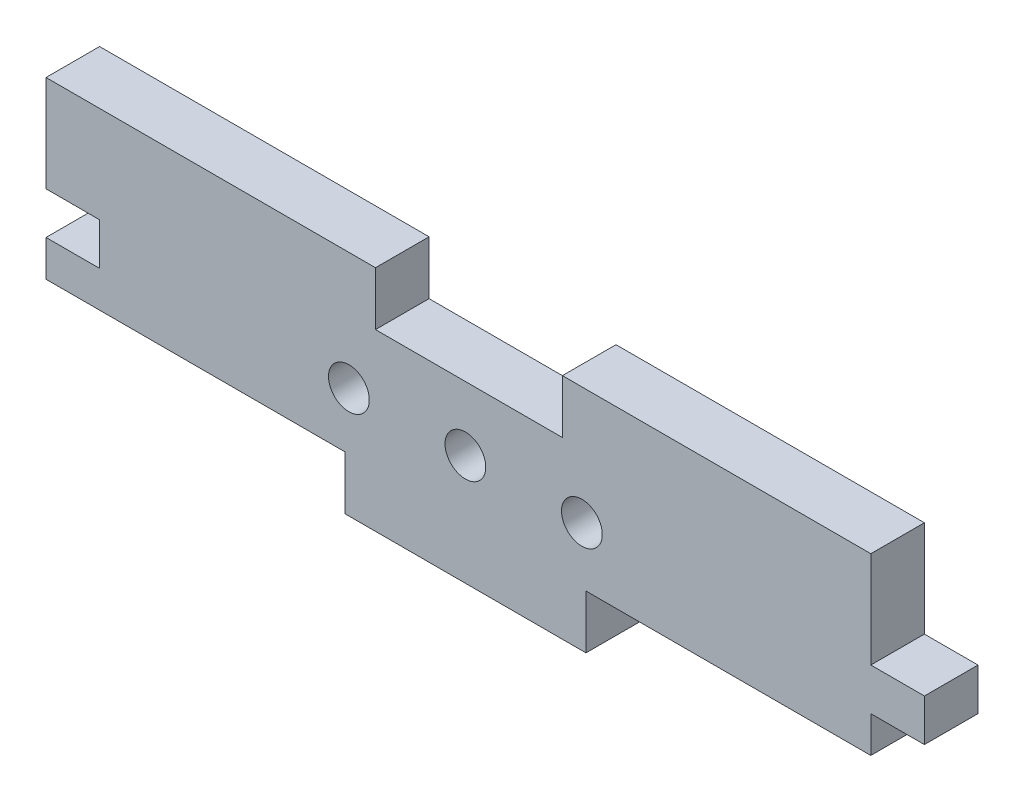
ISO-10303-21;
HEADER;
FILE_DESCRIPTION(('STEP AP214'),'2;1');
FILE_NAME('part.step','',(''),(''),'','','');
FILE_SCHEMA(('AUTOMOTIVE_DESIGN { 1 0 10303 214 1 1 1 1 }'));
ENDSEC;
DATA;
#1=APPLICATION_CONTEXT('core data for automotive mechanical design processes');
#2=APPLICATION_PROTOCOL_DEFINITION('international standard','automotive_design',2000,#1);
#3=PRODUCT_CONTEXT('',#1,'mechanical');
#4=PRODUCT('Part','Part','',(#3));
#5=PRODUCT_RELATED_PRODUCT_CATEGORY('part','',(#4));
#6=PRODUCT_DEFINITION_FORMATION('','',#4);
#7=PRODUCT_DEFINITION_CONTEXT('part definition',#1,'design');
#8=PRODUCT_DEFINITION('design','',#6,#7);
#9=PRODUCT_DEFINITION_SHAPE('','',#8);
#10=(LENGTH_UNIT() NAMED_UNIT(*) SI_UNIT(.MILLI.,.METRE.));
#11=(NAMED_UNIT(*) PLANE_ANGLE_UNIT() SI_UNIT($,.RADIAN.));
#12=(NAMED_UNIT(*) SI_UNIT($,.STERADIAN.) SOLID_ANGLE_UNIT());
#13=UNCERTAINTY_MEASURE_WITH_UNIT(LENGTH_MEASURE(1.E-05),#10,'distance_accuracy_value','');
#14=(GEOMETRIC_REPRESENTATION_CONTEXT(3) GLOBAL_UNCERTAINTY_ASSIGNED_CONTEXT((#13)) GLOBAL_UNIT_ASSIGNED_CONTEXT((#10,
#11,#12)) REPRESENTATION_CONTEXT('',''));
#15=CARTESIAN_POINT('',(0.,0.,0.));
#16=DIRECTION('',(0.,0.,1.));
#17=DIRECTION('',(1.,0.,0.));
#18=AXIS2_PLACEMENT_3D('',#15,#16,#17);
#19=CARTESIAN_POINT('',(0.,15.,4.6));
#20=DIRECTION('',(0.,-1.,0.));
#21=DIRECTION('',(0.,0.,-1.));
#22=AXIS2_PLACEMENT_3D('',#19,#20,#21);
#23=PLANE('',#22);
#24=DIRECTION('',(0.,0.,-1.));
#25=VECTOR('',#24,1.);
#26=CARTESIAN_POINT('',(28.2821640285442,15.,0.));
#27=LINE('',#26,#25);
#28=CARTESIAN_POINT('',(28.2821640285442,15.,4.6));
#29=VERTEX_POINT('',#28);
#30=CARTESIAN_POINT('',(28.2821640285442,15.,0.));
#31=VERTEX_POINT('',#30);
#32=EDGE_CURVE('E348',#29,#31,#27,.T.);
#33=ORIENTED_EDGE('',*,*,#32,.T.);
#34=DIRECTION('',(-1.,0.,0.));
#35=VECTOR('',#34,1.);
#36=CARTESIAN_POINT('',(0.,15.,0.));
#37=LINE('',#36,#35);
#38=CARTESIAN_POINT('',(0.,15.,0.));
#39=VERTEX_POINT('',#38);
#40=EDGE_CURVE('E214',#31,#39,#37,.T.);
#41=ORIENTED_EDGE('',*,*,#40,.T.);
#42=DIRECTION('',(0.,0.,-1.));
#43=VECTOR('',#42,1.);
#44=CARTESIAN_POINT('',(0.,15.,4.6));
#45=LINE('',#44,#43);
#46=CARTESIAN_POINT('',(0.,15.,4.6));
#47=VERTEX_POINT('',#46);
#48=EDGE_CURVE('E228',#47,#39,#45,.T.);
#49=ORIENTED_EDGE('',*,*,#48,.F.);
#50=DIRECTION('',(-1.,0.,0.));
#51=VECTOR('',#50,1.);
#52=CARTESIAN_POINT('',(0.,15.,4.6));
#53=LINE('',#52,#51);
#54=EDGE_CURVE('E301',#29,#47,#53,.T.);
#55=ORIENTED_EDGE('',*,*,#54,.F.);
#56=EDGE_LOOP('',(#33,#41,#49,#55));
#57=FACE_BOUND('',#56,.T.);
#58=ADVANCED_FACE('F31',(#57),#23,.F.);
#59=DIRECTION('',(0.,0.,1.));
#60=VECTOR('',#59,1.);
#61=CARTESIAN_POINT('',(44.3256091099346,15.,0.));
#62=LINE('',#61,#60);
#63=CARTESIAN_POINT('',(44.3256091099346,15.,0.));
#64=VERTEX_POINT('',#63);
#65=CARTESIAN_POINT('',(44.3256091099346,15.,4.6));
#66=VERTEX_POINT('',#65);
#67=EDGE_CURVE('E46',#64,#66,#62,.T.);
#68=ORIENTED_EDGE('',*,*,#67,.T.);
#69=CARTESIAN_POINT('',(70.8,15.,4.6));
#70=VERTEX_POINT('',#69);
#71=EDGE_CURVE('E302',#70,#66,#53,.T.);
#72=ORIENTED_EDGE('',*,*,#71,.F.);
#73=DIRECTION('',(0.,0.,-1.));
#74=VECTOR('',#73,1.);
#75=CARTESIAN_POINT('',(70.8,15.,4.6));
#76=LINE('',#75,#74);
#77=CARTESIAN_POINT('',(70.8,15.,0.));
#78=VERTEX_POINT('',#77);
#79=EDGE_CURVE('E231',#70,#78,#76,.T.);
#80=ORIENTED_EDGE('',*,*,#79,.T.);
#81=EDGE_CURVE('E215',#78,#64,#37,.T.);
#82=ORIENTED_EDGE('',*,*,#81,.T.);
#83=EDGE_LOOP('',(#68,#72,#80,#82));
#84=FACE_BOUND('',#83,.T.);
#85=ADVANCED_FACE('F378',(#84),#23,.F.);
#86=CARTESIAN_POINT('',(0.,3.10839082158942,4.6));
#87=DIRECTION('',(0.,0.,-1.));
#88=DIRECTION('',(-1.,0.,0.));
#89=AXIS2_PLACEMENT_3D('',#86,#87,#88);
#90=PLANE('',#89);
#91=CARTESIAN_POINT('',(36.,4.9,4.6));
#92=DIRECTION('',(0.,0.,-1.));
#93=DIRECTION('',(-1.,0.,0.));
#94=AXIS2_PLACEMENT_3D('',#91,#92,#93);
#95=CIRCLE('',#94,1.75);
#96=CARTESIAN_POINT('',(34.25,4.9,4.6));
#97=VERTEX_POINT('',#96);
#98=EDGE_CURVE('E194',#97,#97,#95,.T.);
#99=ORIENTED_EDGE('',*,*,#98,.T.);
#100=EDGE_LOOP('',(#99));
#101=FACE_BOUND('',#100,.T.);
#102=CARTESIAN_POINT('',(26.,4.9,4.6));
#103=DIRECTION('',(0.,0.,-1.));
#104=DIRECTION('',(-1.,0.,0.));
#105=AXIS2_PLACEMENT_3D('',#102,#103,#104);
#106=CIRCLE('',#105,1.75);
#107=CARTESIAN_POINT('',(24.25,4.9,4.6));
#108=VERTEX_POINT('',#107);
#109=EDGE_CURVE('E325',#108,#108,#106,.T.);
#110=ORIENTED_EDGE('',*,*,#109,.T.);
#111=EDGE_LOOP('',(#110));
#112=FACE_BOUND('',#111,.T.);
#113=CARTESIAN_POINT('',(46.,4.89999999999993,4.6));
#114=DIRECTION('',(0.,0.,-1.));
#115=DIRECTION('',(-1.,0.,0.));
#116=AXIS2_PLACEMENT_3D('',#113,#114,#115);
#117=CIRCLE('',#116,1.75);
#118=CARTESIAN_POINT('',(44.25,4.89999999999993,4.6));
#119=VERTEX_POINT('',#118);
#120=EDGE_CURVE('E331',#119,#119,#117,.T.);
#121=ORIENTED_EDGE('',*,*,#120,.T.);
#122=EDGE_LOOP('',(#121));
#123=FACE_BOUND('',#122,.T.);
#124=DIRECTION('',(0.,1.,0.));
#125=VECTOR('',#124,1.);
#126=CARTESIAN_POINT('',(28.2821640285442,10.4,4.6));
#127=LINE('',#126,#125);
#128=CARTESIAN_POINT('',(28.2821640285442,10.4,4.6));
#129=VERTEX_POINT('',#128);
#130=EDGE_CURVE('E312',#129,#29,#127,.T.);
#131=ORIENTED_EDGE('',*,*,#130,.T.);
#132=ORIENTED_EDGE('',*,*,#54,.T.);
#133=DIRECTION('',(0.,-1.,0.));
#134=VECTOR('',#133,1.);
#135=CARTESIAN_POINT('',(0.,6.72272795381801,4.6));
#136=LINE('',#135,#134);
#137=CARTESIAN_POINT('',(0.,6.72272795381801,4.6));
#138=VERTEX_POINT('',#137);
#139=EDGE_CURVE('E169',#47,#138,#136,.T.);
#140=ORIENTED_EDGE('',*,*,#139,.T.);
#141=DIRECTION('',(1.,0.,0.));
#142=VECTOR('',#141,1.);
#143=CARTESIAN_POINT('',(0.,6.72272795381801,4.6));
#144=LINE('',#143,#142);
#145=CARTESIAN_POINT('',(4.6,6.72272795381801,4.6));
#146=VERTEX_POINT('',#145);
#147=EDGE_CURVE('E161',#138,#146,#144,.T.);
#148=ORIENTED_EDGE('',*,*,#147,.T.);
#149=DIRECTION('',(0.,-1.,0.));
#150=VECTOR('',#149,1.);
#151=CARTESIAN_POINT('',(4.6,3.10839082158942,4.6));
#152=LINE('',#151,#150);
#153=CARTESIAN_POINT('',(4.6,3.10839082158942,4.6));
#154=VERTEX_POINT('',#153);
#155=EDGE_CURVE('E166',#146,#154,#152,.T.);
#156=ORIENTED_EDGE('',*,*,#155,.T.);
#157=DIRECTION('',(-1.,0.,0.));
#158=VECTOR('',#157,1.);
#159=CARTESIAN_POINT('',(0.,3.10839082158942,4.6));
#160=LINE('',#159,#158);
#161=CARTESIAN_POINT('',(0.,3.10839082158942,4.6));
#162=VERTEX_POINT('',#161);
#163=EDGE_CURVE('E55',#154,#162,#160,.T.);
#164=ORIENTED_EDGE('',*,*,#163,.T.);
#165=DIRECTION('',(0.,-1.,0.));
#166=VECTOR('',#165,1.);
#167=CARTESIAN_POINT('',(0.,0.,4.6));
#168=LINE('',#167,#166);
#169=CARTESIAN_POINT('',(0.,0.,4.6));
#170=VERTEX_POINT('',#169);
#171=EDGE_CURVE('E224',#162,#170,#168,.T.);
#172=ORIENTED_EDGE('',*,*,#171,.T.);
#173=DIRECTION('',(1.,0.,0.));
#174=VECTOR('',#173,1.);
#175=CARTESIAN_POINT('',(0.,0.,4.6));
#176=LINE('',#175,#174);
#177=CARTESIAN_POINT('',(25.6498601659265,0.,4.6));
#178=VERTEX_POINT('',#177);
#179=EDGE_CURVE('E121',#170,#178,#176,.T.);
#180=ORIENTED_EDGE('',*,*,#179,.T.);
#181=DIRECTION('',(0.,-1.,0.));
#182=VECTOR('',#181,1.);
#183=CARTESIAN_POINT('',(25.6498601659265,0.,4.6));
#184=LINE('',#183,#182);
#185=CARTESIAN_POINT('',(25.6498601659264,-4.6,4.6));
#186=VERTEX_POINT('',#185);
#187=EDGE_CURVE('E283',#178,#186,#184,.T.);
#188=ORIENTED_EDGE('',*,*,#187,.T.);
#189=DIRECTION('',(1.,0.,0.));
#190=VECTOR('',#189,1.);
#191=CARTESIAN_POINT('',(25.6498601659264,-4.6,4.6));
#192=LINE('',#191,#190);
#193=CARTESIAN_POINT('',(46.3501398340735,-4.6,4.6));
#194=VERTEX_POINT('',#193);
#195=EDGE_CURVE('E280',#186,#194,#192,.T.);
#196=ORIENTED_EDGE('',*,*,#195,.T.);
#197=DIRECTION('',(0.,1.,0.));
#198=VECTOR('',#197,1.);
#199=CARTESIAN_POINT('',(46.3501398340735,0.,4.6));
#200=LINE('',#199,#198);
#201=CARTESIAN_POINT('',(46.3501398340735,0.,4.6));
#202=VERTEX_POINT('',#201);
#203=EDGE_CURVE('E282',#194,#202,#200,.T.);
#204=ORIENTED_EDGE('',*,*,#203,.T.);
#205=DIRECTION('',(1.,0.,0.));
#206=VECTOR('',#205,1.);
#207=CARTESIAN_POINT('',(46.3501398340735,0.,4.6));
#208=LINE('',#207,#206);
#209=CARTESIAN_POINT('',(70.8,0.,4.6));
#210=VERTEX_POINT('',#209);
#211=EDGE_CURVE('E285',#202,#210,#208,.T.);
#212=ORIENTED_EDGE('',*,*,#211,.T.);
#213=DIRECTION('',(0.,1.,0.));
#214=VECTOR('',#213,1.);
#215=CARTESIAN_POINT('',(70.8,0.,4.6));
#216=LINE('',#215,#214);
#217=CARTESIAN_POINT('',(70.8,3.10839082158942,4.6));
#218=VERTEX_POINT('',#217);
#219=EDGE_CURVE('E291',#210,#218,#216,.T.);
#220=ORIENTED_EDGE('',*,*,#219,.T.);
#221=DIRECTION('',(1.,0.,0.));
#222=VECTOR('',#221,1.);
#223=CARTESIAN_POINT('',(70.8,3.10839082158942,4.6));
#224=LINE('',#223,#222);
#225=CARTESIAN_POINT('',(75.4,3.10839082158942,4.6));
#226=VERTEX_POINT('',#225);
#227=EDGE_CURVE('E293',#218,#226,#224,.T.);
#228=ORIENTED_EDGE('',*,*,#227,.T.);
#229=DIRECTION('',(0.,1.,0.));
#230=VECTOR('',#229,1.);
#231=CARTESIAN_POINT('',(75.4,3.10839082158942,4.6));
#232=LINE('',#231,#230);
#233=CARTESIAN_POINT('',(75.4,6.72272795381801,4.6));
#234=VERTEX_POINT('',#233);
#235=EDGE_CURVE('E295',#226,#234,#232,.T.);
#236=ORIENTED_EDGE('',*,*,#235,.T.);
#237=DIRECTION('',(-1.,0.,0.));
#238=VECTOR('',#237,1.);
#239=CARTESIAN_POINT('',(70.8,6.72272795381801,4.6));
#240=LINE('',#239,#238);
#241=CARTESIAN_POINT('',(70.8,6.72272795381801,4.6));
#242=VERTEX_POINT('',#241);
#243=EDGE_CURVE('E297',#234,#242,#240,.T.);
#244=ORIENTED_EDGE('',*,*,#243,.T.);
#245=DIRECTION('',(0.,1.,0.));
#246=VECTOR('',#245,1.);
#247=CARTESIAN_POINT('',(70.8,6.72272795381801,4.6));
#248=LINE('',#247,#246);
#249=EDGE_CURVE('E299',#242,#70,#248,.T.);
#250=ORIENTED_EDGE('',*,*,#249,.T.);
#251=ORIENTED_EDGE('',*,*,#71,.T.);
#252=DIRECTION('',(0.,1.,0.));
#253=VECTOR('',#252,1.);
#254=CARTESIAN_POINT('',(44.3256091099346,10.4,4.6));
#255=LINE('',#254,#253);
#256=CARTESIAN_POINT('',(44.3256091099346,10.4,4.6));
#257=VERTEX_POINT('',#256);
#258=EDGE_CURVE('E342',#257,#66,#255,.T.);
#259=ORIENTED_EDGE('',*,*,#258,.F.);
#260=DIRECTION('',(-1.,0.,0.));
#261=VECTOR('',#260,1.);
#262=CARTESIAN_POINT('',(28.2821640285442,10.4,4.6));
#263=LINE('',#262,#261);
#264=EDGE_CURVE('E354',#257,#129,#263,.T.);
#265=ORIENTED_EDGE('',*,*,#264,.T.);
#266=EDGE_LOOP('',(#131,#132,#140,#148,#156,#164,#172,#180,#188,#196,#204,#212,#220,#228,#236,
#244,#250,#251,#259,#265));
#267=FACE_BOUND('',#266,.T.);
#268=ADVANCED_FACE('F164',(#101,#112,#123,#267),#90,.F.);
#269=CARTESIAN_POINT('',(0.,3.10839082158942,0.));
#270=DIRECTION('',(0.,0.,-1.));
#271=DIRECTION('',(-1.,0.,0.));
#272=AXIS2_PLACEMENT_3D('',#269,#270,#271);
#273=PLANE('',#272);
#274=DIRECTION('',(-1.,0.,0.));
#275=VECTOR('',#274,1.);
#276=CARTESIAN_POINT('',(0.,10.4,0.));
#277=LINE('',#276,#275);
#278=CARTESIAN_POINT('',(44.3256091099346,10.4,0.));
#279=VERTEX_POINT('',#278);
#280=CARTESIAN_POINT('',(28.2821640285442,10.4,0.));
#281=VERTEX_POINT('',#280);
#282=EDGE_CURVE('E11',#279,#281,#277,.T.);
#283=ORIENTED_EDGE('',*,*,#282,.F.);
#284=DIRECTION('',(0.,1.,0.));
#285=VECTOR('',#284,1.);
#286=CARTESIAN_POINT('',(44.3256091099346,10.4,0.));
#287=LINE('',#286,#285);
#288=EDGE_CURVE('E340',#279,#64,#287,.T.);
#289=ORIENTED_EDGE('',*,*,#288,.T.);
#290=ORIENTED_EDGE('',*,*,#81,.F.);
#291=DIRECTION('',(0.,1.,0.));
#292=VECTOR('',#291,1.);
#293=CARTESIAN_POINT('',(70.8,6.72272795381801,0.));
#294=LINE('',#293,#292);
#295=CARTESIAN_POINT('',(70.8,6.72272795381801,0.));
#296=VERTEX_POINT('',#295);
#297=EDGE_CURVE('E212',#296,#78,#294,.T.);
#298=ORIENTED_EDGE('',*,*,#297,.F.);
#299=DIRECTION('',(-1.,0.,0.));
#300=VECTOR('',#299,1.);
#301=CARTESIAN_POINT('',(70.8,6.72272795381801,0.));
#302=LINE('',#301,#300);
#303=CARTESIAN_POINT('',(75.4,6.72272795381801,0.));
#304=VERTEX_POINT('',#303);
#305=EDGE_CURVE('E210',#304,#296,#302,.T.);
#306=ORIENTED_EDGE('',*,*,#305,.F.);
#307=DIRECTION('',(0.,1.,0.));
#308=VECTOR('',#307,1.);
#309=CARTESIAN_POINT('',(75.4,3.10839082158942,0.));
#310=LINE('',#309,#308);
#311=CARTESIAN_POINT('',(75.4,3.10839082158942,0.));
#312=VERTEX_POINT('',#311);
#313=EDGE_CURVE('E208',#312,#304,#310,.T.);
#314=ORIENTED_EDGE('',*,*,#313,.F.);
#315=DIRECTION('',(1.,0.,0.));
#316=VECTOR('',#315,1.);
#317=CARTESIAN_POINT('',(70.8,3.10839082158942,0.));
#318=LINE('',#317,#316);
#319=CARTESIAN_POINT('',(70.8,3.10839082158942,0.));
#320=VERTEX_POINT('',#319);
#321=EDGE_CURVE('E206',#320,#312,#318,.T.);
#322=ORIENTED_EDGE('',*,*,#321,.F.);
#323=DIRECTION('',(0.,1.,0.));
#324=VECTOR('',#323,1.);
#325=CARTESIAN_POINT('',(70.8,0.,0.));
#326=LINE('',#325,#324);
#327=CARTESIAN_POINT('',(70.8,0.,0.));
#328=VERTEX_POINT('',#327);
#329=EDGE_CURVE('E204',#328,#320,#326,.T.);
#330=ORIENTED_EDGE('',*,*,#329,.F.);
#331=DIRECTION('',(1.,0.,0.));
#332=VECTOR('',#331,1.);
#333=CARTESIAN_POINT('',(46.3501398340735,0.,0.));
#334=LINE('',#333,#332);
#335=CARTESIAN_POINT('',(46.3501398340735,0.,0.));
#336=VERTEX_POINT('',#335);
#337=EDGE_CURVE('E202',#336,#328,#334,.T.);
#338=ORIENTED_EDGE('',*,*,#337,.F.);
#339=DIRECTION('',(0.,1.,0.));
#340=VECTOR('',#339,1.);
#341=CARTESIAN_POINT('',(46.3501398340735,0.,0.));
#342=LINE('',#341,#340);
#343=CARTESIAN_POINT('',(46.3501398340735,-4.6,0.));
#344=VERTEX_POINT('',#343);
#345=EDGE_CURVE('E200',#344,#336,#342,.T.);
#346=ORIENTED_EDGE('',*,*,#345,.F.);
#347=DIRECTION('',(1.,0.,0.));
#348=VECTOR('',#347,1.);
#349=CARTESIAN_POINT('',(25.6498601659264,-4.6,0.));
#350=LINE('',#349,#348);
#351=CARTESIAN_POINT('',(25.6498601659264,-4.6,0.));
#352=VERTEX_POINT('',#351);
#353=EDGE_CURVE('E198',#352,#344,#350,.T.);
#354=ORIENTED_EDGE('',*,*,#353,.F.);
#355=DIRECTION('',(0.,-1.,0.));
#356=VECTOR('',#355,1.);
#357=CARTESIAN_POINT('',(25.6498601659265,0.,0.));
#358=LINE('',#357,#356);
#359=CARTESIAN_POINT('',(25.6498601659265,0.,0.));
#360=VERTEX_POINT('',#359);
#361=EDGE_CURVE('E196',#360,#352,#358,.T.);
#362=ORIENTED_EDGE('',*,*,#361,.F.);
#363=DIRECTION('',(1.,0.,0.));
#364=VECTOR('',#363,1.);
#365=CARTESIAN_POINT('',(0.,0.,0.));
#366=LINE('',#365,#364);
#367=CARTESIAN_POINT('',(0.,0.,0.));
#368=VERTEX_POINT('',#367);
#369=EDGE_CURVE('E193',#368,#360,#366,.T.);
#370=ORIENTED_EDGE('',*,*,#369,.F.);
#371=DIRECTION('',(0.,-1.,0.));
#372=VECTOR('',#371,1.);
#373=CARTESIAN_POINT('',(0.,0.,0.));
#374=LINE('',#373,#372);
#375=CARTESIAN_POINT('',(0.,3.10839082158942,0.));
#376=VERTEX_POINT('',#375);
#377=EDGE_CURVE('E190',#376,#368,#374,.T.);
#378=ORIENTED_EDGE('',*,*,#377,.F.);
#379=DIRECTION('',(-1.,0.,0.));
#380=VECTOR('',#379,1.);
#381=CARTESIAN_POINT('',(0.,3.10839082158942,0.));
#382=LINE('',#381,#380);
#383=CARTESIAN_POINT('',(4.6,3.10839082158942,0.));
#384=VERTEX_POINT('',#383);
#385=EDGE_CURVE('E112',#384,#376,#382,.T.);
#386=ORIENTED_EDGE('',*,*,#385,.F.);
#387=DIRECTION('',(0.,-1.,0.));
#388=VECTOR('',#387,1.);
#389=CARTESIAN_POINT('',(4.6,3.10839082158942,0.));
#390=LINE('',#389,#388);
#391=CARTESIAN_POINT('',(4.6,6.72272795381801,0.));
#392=VERTEX_POINT('',#391);
#393=EDGE_CURVE('E221',#392,#384,#390,.T.);
#394=ORIENTED_EDGE('',*,*,#393,.F.);
#395=DIRECTION('',(1.,0.,0.));
#396=VECTOR('',#395,1.);
#397=CARTESIAN_POINT('',(0.,6.72272795381801,0.));
#398=LINE('',#397,#396);
#399=CARTESIAN_POINT('',(0.,6.72272795381801,0.));
#400=VERTEX_POINT('',#399);
#401=EDGE_CURVE('E178',#400,#392,#398,.T.);
#402=ORIENTED_EDGE('',*,*,#401,.F.);
#403=DIRECTION('',(0.,-1.,0.));
#404=VECTOR('',#403,1.);
#405=CARTESIAN_POINT('',(0.,6.72272795381801,0.));
#406=LINE('',#405,#404);
#407=EDGE_CURVE('E218',#39,#400,#406,.T.);
#408=ORIENTED_EDGE('',*,*,#407,.F.);
#409=ORIENTED_EDGE('',*,*,#40,.F.);
#410=DIRECTION('',(0.,1.,0.));
#411=VECTOR('',#410,1.);
#412=CARTESIAN_POINT('',(28.2821640285442,10.4,0.));
#413=LINE('',#412,#411);
#414=EDGE_CURVE('E337',#281,#31,#413,.T.);
#415=ORIENTED_EDGE('',*,*,#414,.F.);
#416=EDGE_LOOP('',(#283,#289,#290,#298,#306,#314,#322,#330,#338,#346,#354,#362,#370,#378,#386,
#394,#402,#408,#409,#415));
#417=FACE_BOUND('',#416,.T.);
#418=CARTESIAN_POINT('',(36.,4.9,0.));
#419=DIRECTION('',(0.,0.,-1.));
#420=DIRECTION('',(-1.,0.,0.));
#421=AXIS2_PLACEMENT_3D('',#418,#419,#420);
#422=CIRCLE('',#421,1.75);
#423=CARTESIAN_POINT('',(34.25,4.9,0.));
#424=VERTEX_POINT('',#423);
#425=EDGE_CURVE('E322',#424,#424,#422,.T.);
#426=ORIENTED_EDGE('',*,*,#425,.F.);
#427=EDGE_LOOP('',(#426));
#428=FACE_BOUND('',#427,.T.);
#429=CARTESIAN_POINT('',(26.,4.9,0.));
#430=DIRECTION('',(0.,0.,-1.));
#431=DIRECTION('',(-1.,0.,0.));
#432=AXIS2_PLACEMENT_3D('',#429,#430,#431);
#433=CIRCLE('',#432,1.75);
#434=CARTESIAN_POINT('',(24.25,4.9,0.));
#435=VERTEX_POINT('',#434);
#436=EDGE_CURVE('E328',#435,#435,#433,.T.);
#437=ORIENTED_EDGE('',*,*,#436,.F.);
#438=EDGE_LOOP('',(#437));
#439=FACE_BOUND('',#438,.T.);
#440=CARTESIAN_POINT('',(46.,4.89999999999993,0.));
#441=DIRECTION('',(0.,0.,-1.));
#442=DIRECTION('',(-1.,0.,0.));
#443=AXIS2_PLACEMENT_3D('',#440,#441,#442);
#444=CIRCLE('',#443,1.75);
#445=CARTESIAN_POINT('',(44.25,4.89999999999993,0.));
#446=VERTEX_POINT('',#445);
#447=EDGE_CURVE('E334',#446,#446,#444,.T.);
#448=ORIENTED_EDGE('',*,*,#447,.F.);
#449=EDGE_LOOP('',(#448));
#450=FACE_BOUND('',#449,.T.);
#451=ADVANCED_FACE('F267',(#417,#428,#439,#450),#273,.T.);
#452=CARTESIAN_POINT('',(0.,0.,4.6));
#453=DIRECTION('',(1.,0.,0.));
#454=DIRECTION('',(0.,0.,-1.));
#455=AXIS2_PLACEMENT_3D('',#452,#453,#454);
#456=PLANE('',#455);
#457=ORIENTED_EDGE('',*,*,#377,.T.);
#458=DIRECTION('',(0.,0.,-1.));
#459=VECTOR('',#458,1.);
#460=CARTESIAN_POINT('',(0.,0.,4.6));
#461=LINE('',#460,#459);
#462=EDGE_CURVE('E39',#170,#368,#461,.T.);
#463=ORIENTED_EDGE('',*,*,#462,.F.);
#464=ORIENTED_EDGE('',*,*,#171,.F.);
#465=DIRECTION('',(0.,0.,-1.));
#466=VECTOR('',#465,1.);
#467=CARTESIAN_POINT('',(0.,3.10839082158942,4.6));
#468=LINE('',#467,#466);
#469=EDGE_CURVE('E186',#162,#376,#468,.T.);
#470=ORIENTED_EDGE('',*,*,#469,.T.);
#471=EDGE_LOOP('',(#457,#463,#464,#470));
#472=FACE_BOUND('',#471,.T.);
#473=ADVANCED_FACE('F33',(#472),#456,.F.);
#474=CARTESIAN_POINT('',(0.,0.,4.6));
#475=DIRECTION('',(0.,1.,0.));
#476=DIRECTION('',(-1.,0.,0.));
#477=AXIS2_PLACEMENT_3D('',#474,#475,#476);
#478=PLANE('',#477);
#479=ORIENTED_EDGE('',*,*,#369,.T.);
#480=DIRECTION('',(0.,0.,-1.));
#481=VECTOR('',#480,1.);
#482=CARTESIAN_POINT('',(25.6498601659265,0.,4.6));
#483=LINE('',#482,#481);
#484=EDGE_CURVE('E258',#178,#360,#483,.T.);
#485=ORIENTED_EDGE('',*,*,#484,.F.);
#486=ORIENTED_EDGE('',*,*,#179,.F.);
#487=ORIENTED_EDGE('',*,*,#462,.T.);
#488=EDGE_LOOP('',(#479,#485,#486,#487));
#489=FACE_BOUND('',#488,.T.);
#490=ADVANCED_FACE('F261',(#489),#478,.F.);
#491=CARTESIAN_POINT('',(25.6498601659265,0.,4.6));
#492=DIRECTION('',(1.,0.,0.));
#493=DIRECTION('',(0.,1.,0.));
#494=AXIS2_PLACEMENT_3D('',#491,#492,#493);
#495=PLANE('',#494);
#496=ORIENTED_EDGE('',*,*,#361,.T.);
#497=DIRECTION('',(0.,0.,-1.));
#498=VECTOR('',#497,1.);
#499=CARTESIAN_POINT('',(25.6498601659264,-4.6,4.6));
#500=LINE('',#499,#498);
#501=EDGE_CURVE('E255',#186,#352,#500,.T.);
#502=ORIENTED_EDGE('',*,*,#501,.F.);
#503=ORIENTED_EDGE('',*,*,#187,.F.);
#504=ORIENTED_EDGE('',*,*,#484,.T.);
#505=EDGE_LOOP('',(#496,#502,#503,#504));
#506=FACE_BOUND('',#505,.T.);
#507=ADVANCED_FACE('F274',(#506),#495,.F.);
#508=CARTESIAN_POINT('',(25.6498601659264,-4.6,4.6));
#509=DIRECTION('',(0.,1.,0.));
#510=DIRECTION('',(0.,0.,1.));
#511=AXIS2_PLACEMENT_3D('',#508,#509,#510);
#512=PLANE('',#511);
#513=ORIENTED_EDGE('',*,*,#353,.T.);
#514=DIRECTION('',(0.,0.,-1.));
#515=VECTOR('',#514,1.);
#516=CARTESIAN_POINT('',(46.3501398340735,-4.6,4.6));
#517=LINE('',#516,#515);
#518=EDGE_CURVE('E252',#194,#344,#517,.T.);
#519=ORIENTED_EDGE('',*,*,#518,.F.);
#520=ORIENTED_EDGE('',*,*,#195,.F.);
#521=ORIENTED_EDGE('',*,*,#501,.T.);
#522=EDGE_LOOP('',(#513,#519,#520,#521));
#523=FACE_BOUND('',#522,.T.);
#524=ADVANCED_FACE('F278',(#523),#512,.F.);
#525=CARTESIAN_POINT('',(46.3501398340735,0.,4.6));
#526=DIRECTION('',(-1.,0.,0.));
#527=DIRECTION('',(0.,0.,1.));
#528=AXIS2_PLACEMENT_3D('',#525,#526,#527);
#529=PLANE('',#528);
#530=ORIENTED_EDGE('',*,*,#345,.T.);
#531=DIRECTION('',(0.,0.,-1.));
#532=VECTOR('',#531,1.);
#533=CARTESIAN_POINT('',(46.3501398340735,0.,4.6));
#534=LINE('',#533,#532);
#535=EDGE_CURVE('E249',#202,#336,#534,.T.);
#536=ORIENTED_EDGE('',*,*,#535,.F.);
#537=ORIENTED_EDGE('',*,*,#203,.F.);
#538=ORIENTED_EDGE('',*,*,#518,.T.);
#539=EDGE_LOOP('',(#530,#536,#537,#538));
#540=FACE_BOUND('',#539,.T.);
#541=ADVANCED_FACE('F410',(#540),#529,.F.);
#542=CARTESIAN_POINT('',(46.3501398340735,0.,4.6));
#543=DIRECTION('',(0.,1.,0.));
#544=DIRECTION('',(-1.,0.,0.));
#545=AXIS2_PLACEMENT_3D('',#542,#543,#544);
#546=PLANE('',#545);
#547=ORIENTED_EDGE('',*,*,#337,.T.);
#548=DIRECTION('',(0.,0.,-1.));
#549=VECTOR('',#548,1.);
#550=CARTESIAN_POINT('',(70.8,0.,4.6));
#551=LINE('',#550,#549);
#552=EDGE_CURVE('E246',#210,#328,#551,.T.);
#553=ORIENTED_EDGE('',*,*,#552,.F.);
#554=ORIENTED_EDGE('',*,*,#211,.F.);
#555=ORIENTED_EDGE('',*,*,#535,.T.);
#556=EDGE_LOOP('',(#547,#553,#554,#555));
#557=FACE_BOUND('',#556,.T.);
#558=ADVANCED_FACE('F407',(#557),#546,.F.);
#559=CARTESIAN_POINT('',(70.8,0.,4.6));
#560=DIRECTION('',(-1.,0.,0.));
#561=DIRECTION('',(0.,0.,1.));
#562=AXIS2_PLACEMENT_3D('',#559,#560,#561);
#563=PLANE('',#562);
#564=ORIENTED_EDGE('',*,*,#329,.T.);
#565=DIRECTION('',(0.,0.,-1.));
#566=VECTOR('',#565,1.);
#567=CARTESIAN_POINT('',(70.8,3.10839082158942,4.6));
#568=LINE('',#567,#566);
#569=EDGE_CURVE('E243',#218,#320,#568,.T.);
#570=ORIENTED_EDGE('',*,*,#569,.F.);
#571=ORIENTED_EDGE('',*,*,#219,.F.);
#572=ORIENTED_EDGE('',*,*,#552,.T.);
#573=EDGE_LOOP('',(#564,#570,#571,#572));
#574=FACE_BOUND('',#573,.T.);
#575=ADVANCED_FACE('F402',(#574),#563,.F.);
#576=CARTESIAN_POINT('',(70.8,3.10839082158942,4.6));
#577=DIRECTION('',(0.,1.,0.));
#578=DIRECTION('',(0.,0.,1.));
#579=AXIS2_PLACEMENT_3D('',#576,#577,#578);
#580=PLANE('',#579);
#581=ORIENTED_EDGE('',*,*,#321,.T.);
#582=DIRECTION('',(0.,0.,-1.));
#583=VECTOR('',#582,1.);
#584=CARTESIAN_POINT('',(75.4,3.10839082158942,4.6));
#585=LINE('',#584,#583);
#586=EDGE_CURVE('E240',#226,#312,#585,.T.);
#587=ORIENTED_EDGE('',*,*,#586,.F.);
#588=ORIENTED_EDGE('',*,*,#227,.F.);
#589=ORIENTED_EDGE('',*,*,#569,.T.);
#590=EDGE_LOOP('',(#581,#587,#588,#589));
#591=FACE_BOUND('',#590,.T.);
#592=ADVANCED_FACE('F397',(#591),#580,.F.);
#593=CARTESIAN_POINT('',(75.4,3.10839082158942,4.6));
#594=DIRECTION('',(-1.,0.,0.));
#595=DIRECTION('',(0.,0.,1.));
#596=AXIS2_PLACEMENT_3D('',#593,#594,#595);
#597=PLANE('',#596);
#598=ORIENTED_EDGE('',*,*,#313,.T.);
#599=DIRECTION('',(0.,0.,-1.));
#600=VECTOR('',#599,1.);
#601=CARTESIAN_POINT('',(75.4,6.72272795381801,4.6));
#602=LINE('',#601,#600);
#603=EDGE_CURVE('E237',#234,#304,#602,.T.);
#604=ORIENTED_EDGE('',*,*,#603,.F.);
#605=ORIENTED_EDGE('',*,*,#235,.F.);
#606=ORIENTED_EDGE('',*,*,#586,.T.);
#607=EDGE_LOOP('',(#598,#604,#605,#606));
#608=FACE_BOUND('',#607,.T.);
#609=ADVANCED_FACE('F393',(#608),#597,.F.);
#610=CARTESIAN_POINT('',(70.8,6.72272795381801,4.6));
#611=DIRECTION('',(0.,-1.,0.));
#612=DIRECTION('',(0.,0.,-1.));
#613=AXIS2_PLACEMENT_3D('',#610,#611,#612);
#614=PLANE('',#613);
#615=ORIENTED_EDGE('',*,*,#305,.T.);
#616=DIRECTION('',(0.,0.,-1.));
#617=VECTOR('',#616,1.);
#618=CARTESIAN_POINT('',(70.8,6.72272795381801,4.6));
#619=LINE('',#618,#617);
#620=EDGE_CURVE('E234',#242,#296,#619,.T.);
#621=ORIENTED_EDGE('',*,*,#620,.F.);
#622=ORIENTED_EDGE('',*,*,#243,.F.);
#623=ORIENTED_EDGE('',*,*,#603,.T.);
#624=EDGE_LOOP('',(#615,#621,#622,#623));
#625=FACE_BOUND('',#624,.T.);
#626=ADVANCED_FACE('F388',(#625),#614,.F.);
#627=CARTESIAN_POINT('',(70.8,6.72272795381801,4.6));
#628=DIRECTION('',(-1.,0.,0.));
#629=DIRECTION('',(0.,0.,1.));
#630=AXIS2_PLACEMENT_3D('',#627,#628,#629);
#631=PLANE('',#630);
#632=ORIENTED_EDGE('',*,*,#297,.T.);
#633=ORIENTED_EDGE('',*,*,#79,.F.);
#634=ORIENTED_EDGE('',*,*,#249,.F.);
#635=ORIENTED_EDGE('',*,*,#620,.T.);
#636=EDGE_LOOP('',(#632,#633,#634,#635));
#637=FACE_BOUND('',#636,.T.);
#638=ADVANCED_FACE('F382',(#637),#631,.F.);
#639=CARTESIAN_POINT('',(0.,6.72272795381801,4.6));
#640=DIRECTION('',(1.,0.,0.));
#641=DIRECTION('',(0.,0.,-1.));
#642=AXIS2_PLACEMENT_3D('',#639,#640,#641);
#643=PLANE('',#642);
#644=DIRECTION('',(0.,0.,-1.));
#645=VECTOR('',#644,1.);
#646=CARTESIAN_POINT('',(0.,6.72272795381801,4.6));
#647=LINE('',#646,#645);
#648=EDGE_CURVE('E181',#138,#400,#647,.T.);
#649=ORIENTED_EDGE('',*,*,#648,.F.);
#650=ORIENTED_EDGE('',*,*,#139,.F.);
#651=ORIENTED_EDGE('',*,*,#48,.T.);
#652=ORIENTED_EDGE('',*,*,#407,.T.);
#653=EDGE_LOOP('',(#649,#650,#651,#652));
#654=FACE_BOUND('',#653,.T.);
#655=ADVANCED_FACE('F318',(#654),#643,.F.);
#656=CARTESIAN_POINT('',(0.,6.72272795381801,4.6));
#657=DIRECTION('',(0.,1.,0.));
#658=DIRECTION('',(0.,0.,1.));
#659=AXIS2_PLACEMENT_3D('',#656,#657,#658);
#660=PLANE('',#659);
#661=ORIENTED_EDGE('',*,*,#401,.T.);
#662=DIRECTION('',(0.,0.,-1.));
#663=VECTOR('',#662,1.);
#664=CARTESIAN_POINT('',(4.6,6.72272795381801,4.6));
#665=LINE('',#664,#663);
#666=EDGE_CURVE('E175',#146,#392,#665,.T.);
#667=ORIENTED_EDGE('',*,*,#666,.F.);
#668=ORIENTED_EDGE('',*,*,#147,.F.);
#669=ORIENTED_EDGE('',*,*,#648,.T.);
#670=EDGE_LOOP('',(#661,#667,#668,#669));
#671=FACE_BOUND('',#670,.T.);
#672=ADVANCED_FACE('F176',(#671),#660,.F.);
#673=CARTESIAN_POINT('',(4.6,3.10839082158942,4.6));
#674=DIRECTION('',(1.,0.,0.));
#675=DIRECTION('',(0.,0.,-1.));
#676=AXIS2_PLACEMENT_3D('',#673,#674,#675);
#677=PLANE('',#676);
#678=ORIENTED_EDGE('',*,*,#393,.T.);
#679=DIRECTION('',(0.,0.,-1.));
#680=VECTOR('',#679,1.);
#681=CARTESIAN_POINT('',(4.6,3.10839082158942,4.6));
#682=LINE('',#681,#680);
#683=EDGE_CURVE('E182',#154,#384,#682,.T.);
#684=ORIENTED_EDGE('',*,*,#683,.F.);
#685=ORIENTED_EDGE('',*,*,#155,.F.);
#686=ORIENTED_EDGE('',*,*,#666,.T.);
#687=EDGE_LOOP('',(#678,#684,#685,#686));
#688=FACE_BOUND('',#687,.T.);
#689=ADVANCED_FACE('F184',(#688),#677,.F.);
#690=CARTESIAN_POINT('',(0.,3.10839082158942,4.6));
#691=DIRECTION('',(0.,-1.,0.));
#692=DIRECTION('',(0.,0.,-1.));
#693=AXIS2_PLACEMENT_3D('',#690,#691,#692);
#694=PLANE('',#693);
#695=ORIENTED_EDGE('',*,*,#385,.T.);
#696=ORIENTED_EDGE('',*,*,#469,.F.);
#697=ORIENTED_EDGE('',*,*,#163,.F.);
#698=ORIENTED_EDGE('',*,*,#683,.T.);
#699=EDGE_LOOP('',(#695,#696,#697,#698));
#700=FACE_BOUND('',#699,.T.);
#701=ADVANCED_FACE('F319',(#700),#694,.F.);
#702=CARTESIAN_POINT('',(36.,4.9,4.6));
#703=DIRECTION('',(0.,0.,-1.));
#704=DIRECTION('',(-1.,0.,0.));
#705=AXIS2_PLACEMENT_3D('',#702,#703,#704);
#706=CYLINDRICAL_SURFACE('',#705,1.75);
#707=ORIENTED_EDGE('',*,*,#98,.F.);
#708=EDGE_LOOP('',(#707));
#709=FACE_BOUND('',#708,.T.);
#710=ORIENTED_EDGE('',*,*,#425,.T.);
#711=EDGE_LOOP('',(#710));
#712=FACE_BOUND('',#711,.T.);
#713=ADVANCED_FACE('F481',(#709,#712),#706,.F.);
#714=CARTESIAN_POINT('',(26.,4.9,4.6));
#715=DIRECTION('',(0.,0.,-1.));
#716=DIRECTION('',(-1.,0.,0.));
#717=AXIS2_PLACEMENT_3D('',#714,#715,#716);
#718=CYLINDRICAL_SURFACE('',#717,1.75);
#719=ORIENTED_EDGE('',*,*,#109,.F.);
#720=EDGE_LOOP('',(#719));
#721=FACE_BOUND('',#720,.T.);
#722=ORIENTED_EDGE('',*,*,#436,.T.);
#723=EDGE_LOOP('',(#722));
#724=FACE_BOUND('',#723,.T.);
#725=ADVANCED_FACE('F488',(#721,#724),#718,.F.);
#726=CARTESIAN_POINT('',(46.,4.89999999999993,4.6));
#727=DIRECTION('',(0.,0.,-1.));
#728=DIRECTION('',(-1.,0.,0.));
#729=AXIS2_PLACEMENT_3D('',#726,#727,#728);
#730=CYLINDRICAL_SURFACE('',#729,1.75);
#731=ORIENTED_EDGE('',*,*,#120,.F.);
#732=EDGE_LOOP('',(#731));
#733=FACE_BOUND('',#732,.T.);
#734=ORIENTED_EDGE('',*,*,#447,.T.);
#735=EDGE_LOOP('',(#734));
#736=FACE_BOUND('',#735,.T.);
#737=ADVANCED_FACE('F496',(#733,#736),#730,.F.);
#738=CARTESIAN_POINT('',(85.4,10.4,-9.69999999999997));
#739=DIRECTION('',(0.,-1.,0.));
#740=DIRECTION('',(0.,0.,-1.));
#741=AXIS2_PLACEMENT_3D('',#738,#739,#740);
#742=PLANE('',#741);
#743=ORIENTED_EDGE('',*,*,#282,.T.);
#744=DIRECTION('',(0.,0.,-1.));
#745=VECTOR('',#744,1.);
#746=CARTESIAN_POINT('',(28.2821640285442,10.4,0.));
#747=LINE('',#746,#745);
#748=EDGE_CURVE('E343',#129,#281,#747,.T.);
#749=ORIENTED_EDGE('',*,*,#748,.F.);
#750=ORIENTED_EDGE('',*,*,#264,.F.);
#751=DIRECTION('',(0.,0.,1.));
#752=VECTOR('',#751,1.);
#753=CARTESIAN_POINT('',(44.3256091099346,10.4,0.));
#754=LINE('',#753,#752);
#755=EDGE_CURVE('E350',#279,#257,#754,.T.);
#756=ORIENTED_EDGE('',*,*,#755,.F.);
#757=EDGE_LOOP('',(#743,#749,#750,#756));
#758=FACE_BOUND('',#757,.T.);
#759=ADVANCED_FACE('F367',(#758),#742,.F.);
#760=CARTESIAN_POINT('',(28.2821640285442,10.4,0.));
#761=DIRECTION('',(1.,0.,0.));
#762=DIRECTION('',(0.,0.,1.));
#763=AXIS2_PLACEMENT_3D('',#760,#761,#762);
#764=PLANE('',#763);
#765=ORIENTED_EDGE('',*,*,#32,.F.);
#766=ORIENTED_EDGE('',*,*,#130,.F.);
#767=ORIENTED_EDGE('',*,*,#748,.T.);
#768=ORIENTED_EDGE('',*,*,#414,.T.);
#769=EDGE_LOOP('',(#765,#766,#767,#768));
#770=FACE_BOUND('',#769,.T.);
#771=ADVANCED_FACE('F371',(#770),#764,.T.);
#772=CARTESIAN_POINT('',(44.3256091099346,10.4,0.));
#773=DIRECTION('',(-1.,0.,0.));
#774=DIRECTION('',(0.,1.,0.));
#775=AXIS2_PLACEMENT_3D('',#772,#773,#774);
#776=PLANE('',#775);
#777=ORIENTED_EDGE('',*,*,#67,.F.);
#778=ORIENTED_EDGE('',*,*,#288,.F.);
#779=ORIENTED_EDGE('',*,*,#755,.T.);
#780=ORIENTED_EDGE('',*,*,#258,.T.);
#781=EDGE_LOOP('',(#777,#778,#779,#780));
#782=FACE_BOUND('',#781,.T.);
#783=ADVANCED_FACE('F359',(#782),#776,.T.);
#784=CLOSED_SHELL('',(#58,#85,#268,#451,#473,#490,#507,#524,#541,#558,#575,#592,#609,#626,#638,
#655,#672,#689,#701,#713,#725,#737,#759,#771,#783));
#785=MANIFOLD_SOLID_BREP('B2',#784);
#786=ADVANCED_BREP_SHAPE_REPRESENTATION('',(#18,#785),#14);
#787=SHAPE_DEFINITION_REPRESENTATION(#9,#786);
ENDSEC;
END-ISO-10303-21;
